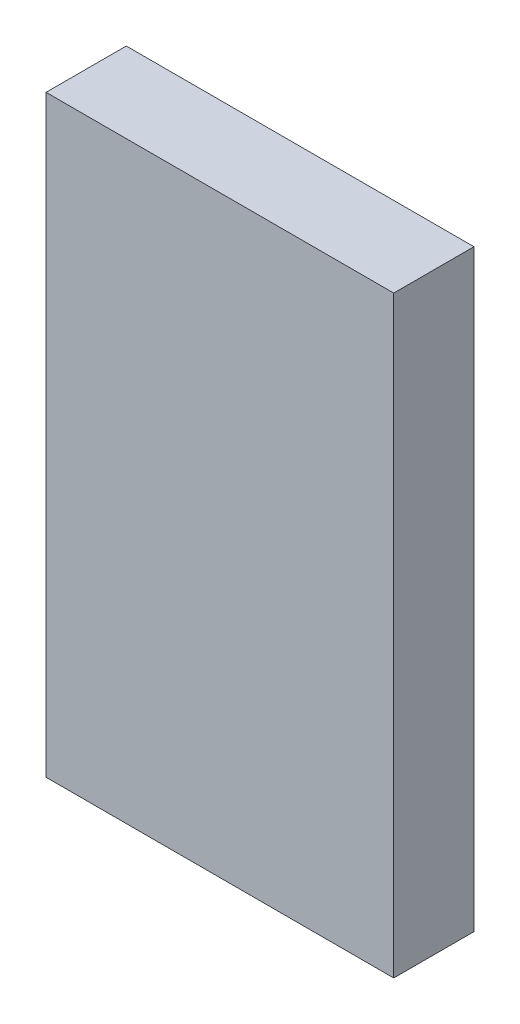
ISO-10303-21;
HEADER;
FILE_DESCRIPTION(('STEP AP214'),'2;1');
FILE_NAME('part.step','',(''),(''),'','','');
FILE_SCHEMA(('AUTOMOTIVE_DESIGN { 1 0 10303 214 1 1 1 1 }'));
ENDSEC;
DATA;
#1=APPLICATION_CONTEXT('core data for automotive mechanical design processes');
#2=APPLICATION_PROTOCOL_DEFINITION('international standard','automotive_design',2000,#1);
#3=PRODUCT_CONTEXT('',#1,'mechanical');
#4=PRODUCT('Part','Part','',(#3));
#5=PRODUCT_RELATED_PRODUCT_CATEGORY('part','',(#4));
#6=PRODUCT_DEFINITION_FORMATION('','',#4);
#7=PRODUCT_DEFINITION_CONTEXT('part definition',#1,'design');
#8=PRODUCT_DEFINITION('design','',#6,#7);
#9=PRODUCT_DEFINITION_SHAPE('','',#8);
#10=(LENGTH_UNIT() NAMED_UNIT(*) SI_UNIT(.MILLI.,.METRE.));
#11=(NAMED_UNIT(*) PLANE_ANGLE_UNIT() SI_UNIT($,.RADIAN.));
#12=(NAMED_UNIT(*) SI_UNIT($,.STERADIAN.) SOLID_ANGLE_UNIT());
#13=UNCERTAINTY_MEASURE_WITH_UNIT(LENGTH_MEASURE(1.E-05),#10,'distance_accuracy_value','');
#14=(GEOMETRIC_REPRESENTATION_CONTEXT(3) GLOBAL_UNCERTAINTY_ASSIGNED_CONTEXT((#13)) GLOBAL_UNIT_ASSIGNED_CONTEXT((#10,
#11,#12)) REPRESENTATION_CONTEXT('',''));
#15=CARTESIAN_POINT('',(0.,0.,0.));
#16=DIRECTION('',(0.,0.,1.));
#17=DIRECTION('',(1.,0.,0.));
#18=AXIS2_PLACEMENT_3D('',#15,#16,#17);
#19=CARTESIAN_POINT('',(0.,-19.18,-2.));
#20=DIRECTION('',(0.,-1.,0.));
#21=DIRECTION('',(0.,0.,-1.));
#22=AXIS2_PLACEMENT_3D('',#19,#20,#21);
#23=PLANE('',#22);
#24=DIRECTION('',(0.,0.,1.));
#25=VECTOR('',#24,1.);
#26=CARTESIAN_POINT('',(10.,-19.18,-2.));
#27=LINE('',#26,#25);
#28=CARTESIAN_POINT('',(10.,-19.18,-2.));
#29=VERTEX_POINT('',#28);
#30=CARTESIAN_POINT('',(10.,-19.18,1.));
#31=VERTEX_POINT('',#30);
#32=EDGE_CURVE('E166',#29,#31,#27,.T.);
#33=ORIENTED_EDGE('',*,*,#32,.T.);
#34=DIRECTION('',(1.,0.,0.));
#35=VECTOR('',#34,1.);
#36=CARTESIAN_POINT('',(10.,-19.18,1.));
#37=LINE('',#36,#35);
#38=CARTESIAN_POINT('',(-3.,-19.18,1.));
#39=VERTEX_POINT('',#38);
#40=EDGE_CURVE('E181',#39,#31,#37,.T.);
#41=ORIENTED_EDGE('',*,*,#40,.F.);
#42=DIRECTION('',(0.,0.,1.));
#43=VECTOR('',#42,1.);
#44=CARTESIAN_POINT('',(-3.,-19.18,-2.));
#45=LINE('',#44,#43);
#46=CARTESIAN_POINT('',(-3.,-19.18,-2.));
#47=VERTEX_POINT('',#46);
#48=EDGE_CURVE('E11',#47,#39,#45,.T.);
#49=ORIENTED_EDGE('',*,*,#48,.F.);
#50=DIRECTION('',(1.,0.,0.));
#51=VECTOR('',#50,1.);
#52=CARTESIAN_POINT('',(0.,-19.18,-2.));
#53=LINE('',#52,#51);
#54=EDGE_CURVE('E170',#47,#29,#53,.T.);
#55=ORIENTED_EDGE('',*,*,#54,.T.);
#56=EDGE_LOOP('',(#33,#41,#49,#55));
#57=FACE_BOUND('',#56,.T.);
#58=ADVANCED_FACE('F32',(#57),#23,.T.);
#59=CARTESIAN_POINT('',(-3.,0.,-2.));
#60=DIRECTION('',(1.,0.,0.));
#61=DIRECTION('',(0.,0.,-1.));
#62=AXIS2_PLACEMENT_3D('',#59,#60,#61);
#63=PLANE('',#62);
#64=ORIENTED_EDGE('',*,*,#48,.T.);
#65=DIRECTION('',(0.,-1.,0.));
#66=VECTOR('',#65,1.);
#67=CARTESIAN_POINT('',(-3.,3.,1.));
#68=LINE('',#67,#66);
#69=CARTESIAN_POINT('',(-3.,3.,1.));
#70=VERTEX_POINT('',#69);
#71=EDGE_CURVE('E275',#70,#39,#68,.T.);
#72=ORIENTED_EDGE('',*,*,#71,.F.);
#73=DIRECTION('',(0.,0.,1.));
#74=VECTOR('',#73,1.);
#75=CARTESIAN_POINT('',(-3.,3.,-2.));
#76=LINE('',#75,#74);
#77=CARTESIAN_POINT('',(-3.,3.,-2.));
#78=VERTEX_POINT('',#77);
#79=EDGE_CURVE('E42',#78,#70,#76,.T.);
#80=ORIENTED_EDGE('',*,*,#79,.F.);
#81=DIRECTION('',(0.,1.,0.));
#82=VECTOR('',#81,1.);
#83=CARTESIAN_POINT('',(-3.,0.,-2.));
#84=LINE('',#83,#82);
#85=EDGE_CURVE('E151',#47,#78,#84,.T.);
#86=ORIENTED_EDGE('',*,*,#85,.F.);
#87=EDGE_LOOP('',(#64,#72,#80,#86));
#88=FACE_BOUND('',#87,.T.);
#89=ADVANCED_FACE('F290',(#88),#63,.F.);
#90=CARTESIAN_POINT('',(0.,3.,-2.));
#91=DIRECTION('',(0.,-1.,0.));
#92=DIRECTION('',(0.,0.,-1.));
#93=AXIS2_PLACEMENT_3D('',#90,#91,#92);
#94=PLANE('',#93);
#95=ORIENTED_EDGE('',*,*,#79,.T.);
#96=DIRECTION('',(-1.,0.,0.));
#97=VECTOR('',#96,1.);
#98=CARTESIAN_POINT('',(10.,3.,1.));
#99=LINE('',#98,#97);
#100=CARTESIAN_POINT('',(10.,3.,1.));
#101=VERTEX_POINT('',#100);
#102=EDGE_CURVE('E162',#101,#70,#99,.T.);
#103=ORIENTED_EDGE('',*,*,#102,.F.);
#104=DIRECTION('',(0.,0.,1.));
#105=VECTOR('',#104,1.);
#106=CARTESIAN_POINT('',(10.,3.,-2.));
#107=LINE('',#106,#105);
#108=CARTESIAN_POINT('',(10.,3.,-2.));
#109=VERTEX_POINT('',#108);
#110=EDGE_CURVE('E158',#109,#101,#107,.T.);
#111=ORIENTED_EDGE('',*,*,#110,.F.);
#112=DIRECTION('',(1.,0.,0.));
#113=VECTOR('',#112,1.);
#114=CARTESIAN_POINT('',(0.,3.,-2.));
#115=LINE('',#114,#113);
#116=EDGE_CURVE('E145',#78,#109,#115,.T.);
#117=ORIENTED_EDGE('',*,*,#116,.F.);
#118=EDGE_LOOP('',(#95,#103,#111,#117));
#119=FACE_BOUND('',#118,.T.);
#120=ADVANCED_FACE('F159',(#119),#94,.F.);
#121=CARTESIAN_POINT('',(0.,-9.,-2.));
#122=DIRECTION('',(0.,1.,0.));
#123=DIRECTION('',(0.,0.,1.));
#124=AXIS2_PLACEMENT_3D('',#121,#122,#123);
#125=PLANE('',#124);
#126=DIRECTION('',(-1.,0.,0.));
#127=VECTOR('',#126,1.);
#128=CARTESIAN_POINT('',(0.,-9.,0.));
#129=LINE('',#128,#127);
#130=CARTESIAN_POINT('',(7.,-9.,0.));
#131=VERTEX_POINT('',#130);
#132=CARTESIAN_POINT('',(2.,-9.,0.));
#133=VERTEX_POINT('',#132);
#134=EDGE_CURVE('E177',#131,#133,#129,.T.);
#135=ORIENTED_EDGE('',*,*,#134,.F.);
#136=DIRECTION('',(0.,0.,1.));
#137=VECTOR('',#136,1.);
#138=CARTESIAN_POINT('',(7.,-9.,-2.));
#139=LINE('',#138,#137);
#140=CARTESIAN_POINT('',(7.,-9.,-2.));
#141=VERTEX_POINT('',#140);
#142=EDGE_CURVE('E96',#141,#131,#139,.T.);
#143=ORIENTED_EDGE('',*,*,#142,.F.);
#144=DIRECTION('',(-1.,0.,0.));
#145=VECTOR('',#144,1.);
#146=CARTESIAN_POINT('',(0.,-9.,-2.));
#147=LINE('',#146,#145);
#148=CARTESIAN_POINT('',(2.,-9.,-2.));
#149=VERTEX_POINT('',#148);
#150=EDGE_CURVE('E207',#141,#149,#147,.T.);
#151=ORIENTED_EDGE('',*,*,#150,.T.);
#152=DIRECTION('',(0.,0.,1.));
#153=VECTOR('',#152,1.);
#154=CARTESIAN_POINT('',(2.,-9.,-2.));
#155=LINE('',#154,#153);
#156=EDGE_CURVE('E36',#149,#133,#155,.T.);
#157=ORIENTED_EDGE('',*,*,#156,.T.);
#158=EDGE_LOOP('',(#135,#143,#151,#157));
#159=FACE_BOUND('',#158,.T.);
#160=ADVANCED_FACE('F34',(#159),#125,.T.);
#161=CARTESIAN_POINT('',(7.,0.,-2.));
#162=DIRECTION('',(1.,0.,0.));
#163=DIRECTION('',(0.,0.,-1.));
#164=AXIS2_PLACEMENT_3D('',#161,#162,#163);
#165=PLANE('',#164);
#166=DIRECTION('',(0.,1.,0.));
#167=VECTOR('',#166,1.);
#168=CARTESIAN_POINT('',(7.,0.,0.));
#169=LINE('',#168,#167);
#170=CARTESIAN_POINT('',(7.,-3.,0.));
#171=VERTEX_POINT('',#170);
#172=EDGE_CURVE('E206',#131,#171,#169,.T.);
#173=ORIENTED_EDGE('',*,*,#172,.T.);
#174=DIRECTION('',(0.,0.,1.));
#175=VECTOR('',#174,1.);
#176=CARTESIAN_POINT('',(7.,-3.,-2.));
#177=LINE('',#176,#175);
#178=CARTESIAN_POINT('',(7.,-3.,-2.));
#179=VERTEX_POINT('',#178);
#180=EDGE_CURVE('E89',#179,#171,#177,.T.);
#181=ORIENTED_EDGE('',*,*,#180,.F.);
#182=DIRECTION('',(0.,1.,0.));
#183=VECTOR('',#182,1.);
#184=CARTESIAN_POINT('',(7.,0.,-2.));
#185=LINE('',#184,#183);
#186=EDGE_CURVE('E172',#141,#179,#185,.T.);
#187=ORIENTED_EDGE('',*,*,#186,.F.);
#188=ORIENTED_EDGE('',*,*,#142,.T.);
#189=EDGE_LOOP('',(#173,#181,#187,#188));
#190=FACE_BOUND('',#189,.T.);
#191=ADVANCED_FACE('F244',(#190),#165,.F.);
#192=CARTESIAN_POINT('',(0.,-3.,-2.));
#193=DIRECTION('',(0.,-1.,0.));
#194=DIRECTION('',(0.,0.,-1.));
#195=AXIS2_PLACEMENT_3D('',#192,#193,#194);
#196=PLANE('',#195);
#197=DIRECTION('',(1.,0.,0.));
#198=VECTOR('',#197,1.);
#199=CARTESIAN_POINT('',(0.,-3.,0.));
#200=LINE('',#199,#198);
#201=CARTESIAN_POINT('',(2.,-3.,0.));
#202=VERTEX_POINT('',#201);
#203=EDGE_CURVE('E203',#202,#171,#200,.T.);
#204=ORIENTED_EDGE('',*,*,#203,.F.);
#205=DIRECTION('',(0.,0.,1.));
#206=VECTOR('',#205,1.);
#207=CARTESIAN_POINT('',(2.,-3.,-2.));
#208=LINE('',#207,#206);
#209=CARTESIAN_POINT('',(2.,-3.,-2.));
#210=VERTEX_POINT('',#209);
#211=EDGE_CURVE('E213',#210,#202,#208,.T.);
#212=ORIENTED_EDGE('',*,*,#211,.F.);
#213=DIRECTION('',(1.,0.,0.));
#214=VECTOR('',#213,1.);
#215=CARTESIAN_POINT('',(0.,-3.,-2.));
#216=LINE('',#215,#214);
#217=EDGE_CURVE('E246',#210,#179,#216,.T.);
#218=ORIENTED_EDGE('',*,*,#217,.T.);
#219=ORIENTED_EDGE('',*,*,#180,.T.);
#220=EDGE_LOOP('',(#204,#212,#218,#219));
#221=FACE_BOUND('',#220,.T.);
#222=ADVANCED_FACE('F247',(#221),#196,.T.);
#223=CARTESIAN_POINT('',(2.,0.,-2.));
#224=DIRECTION('',(-1.,0.,0.));
#225=DIRECTION('',(0.,-1.,0.));
#226=AXIS2_PLACEMENT_3D('',#223,#224,#225);
#227=PLANE('',#226);
#228=DIRECTION('',(0.,-1.,0.));
#229=VECTOR('',#228,1.);
#230=CARTESIAN_POINT('',(2.,0.,0.));
#231=LINE('',#230,#229);
#232=CARTESIAN_POINT('',(2.,0.,0.));
#233=VERTEX_POINT('',#232);
#234=EDGE_CURVE('E200',#233,#202,#231,.T.);
#235=ORIENTED_EDGE('',*,*,#234,.F.);
#236=DIRECTION('',(0.,0.,1.));
#237=VECTOR('',#236,1.);
#238=CARTESIAN_POINT('',(2.,0.,-2.));
#239=LINE('',#238,#237);
#240=CARTESIAN_POINT('',(2.,0.,-2.));
#241=VERTEX_POINT('',#240);
#242=EDGE_CURVE('E215',#241,#233,#239,.T.);
#243=ORIENTED_EDGE('',*,*,#242,.F.);
#244=DIRECTION('',(0.,-1.,0.));
#245=VECTOR('',#244,1.);
#246=CARTESIAN_POINT('',(2.,0.,-2.));
#247=LINE('',#246,#245);
#248=EDGE_CURVE('E251',#241,#210,#247,.T.);
#249=ORIENTED_EDGE('',*,*,#248,.T.);
#250=ORIENTED_EDGE('',*,*,#211,.T.);
#251=EDGE_LOOP('',(#235,#243,#249,#250));
#252=FACE_BOUND('',#251,.T.);
#253=ADVANCED_FACE('F304',(#252),#227,.T.);
#254=CARTESIAN_POINT('',(0.,0.,-2.));
#255=DIRECTION('',(0.,-1.,0.));
#256=DIRECTION('',(0.,0.,-1.));
#257=AXIS2_PLACEMENT_3D('',#254,#255,#256);
#258=PLANE('',#257);
#259=DIRECTION('',(1.,0.,0.));
#260=VECTOR('',#259,1.);
#261=CARTESIAN_POINT('',(0.,0.,0.));
#262=LINE('',#261,#260);
#263=CARTESIAN_POINT('',(0.,0.,0.));
#264=VERTEX_POINT('',#263);
#265=EDGE_CURVE('E197',#264,#233,#262,.T.);
#266=ORIENTED_EDGE('',*,*,#265,.F.);
#267=DIRECTION('',(0.,0.,1.));
#268=VECTOR('',#267,1.);
#269=CARTESIAN_POINT('',(0.,0.,-2.));
#270=LINE('',#269,#268);
#271=CARTESIAN_POINT('',(0.,0.,-2.));
#272=VERTEX_POINT('',#271);
#273=EDGE_CURVE('E217',#272,#264,#270,.T.);
#274=ORIENTED_EDGE('',*,*,#273,.F.);
#275=DIRECTION('',(1.,0.,0.));
#276=VECTOR('',#275,1.);
#277=CARTESIAN_POINT('',(0.,0.,-2.));
#278=LINE('',#277,#276);
#279=EDGE_CURVE('E253',#272,#241,#278,.T.);
#280=ORIENTED_EDGE('',*,*,#279,.T.);
#281=ORIENTED_EDGE('',*,*,#242,.T.);
#282=EDGE_LOOP('',(#266,#274,#280,#281));
#283=FACE_BOUND('',#282,.T.);
#284=ADVANCED_FACE('F307',(#283),#258,.T.);
#285=CARTESIAN_POINT('',(0.,0.,-2.));
#286=DIRECTION('',(-1.,0.,0.));
#287=DIRECTION('',(0.,-1.,0.));
#288=AXIS2_PLACEMENT_3D('',#285,#286,#287);
#289=PLANE('',#288);
#290=DIRECTION('',(0.,-1.,0.));
#291=VECTOR('',#290,1.);
#292=CARTESIAN_POINT('',(0.,0.,0.));
#293=LINE('',#292,#291);
#294=CARTESIAN_POINT('',(0.,-5.,0.));
#295=VERTEX_POINT('',#294);
#296=EDGE_CURVE('E195',#264,#295,#293,.T.);
#297=ORIENTED_EDGE('',*,*,#296,.T.);
#298=DIRECTION('',(0.,0.,1.));
#299=VECTOR('',#298,1.);
#300=CARTESIAN_POINT('',(0.,-5.,-2.));
#301=LINE('',#300,#299);
#302=CARTESIAN_POINT('',(0.,-5.,-2.));
#303=VERTEX_POINT('',#302);
#304=EDGE_CURVE('E219',#303,#295,#301,.T.);
#305=ORIENTED_EDGE('',*,*,#304,.F.);
#306=DIRECTION('',(0.,-1.,0.));
#307=VECTOR('',#306,1.);
#308=CARTESIAN_POINT('',(0.,0.,-2.));
#309=LINE('',#308,#307);
#310=EDGE_CURVE('E258',#272,#303,#309,.T.);
#311=ORIENTED_EDGE('',*,*,#310,.F.);
#312=ORIENTED_EDGE('',*,*,#273,.T.);
#313=EDGE_LOOP('',(#297,#305,#311,#312));
#314=FACE_BOUND('',#313,.T.);
#315=ADVANCED_FACE('F311',(#314),#289,.F.);
#316=CARTESIAN_POINT('',(0.,-5.,-2.));
#317=DIRECTION('',(0.,-1.,0.));
#318=DIRECTION('',(1.,0.,0.));
#319=AXIS2_PLACEMENT_3D('',#316,#317,#318);
#320=PLANE('',#319);
#321=DIRECTION('',(1.,0.,0.));
#322=VECTOR('',#321,1.);
#323=CARTESIAN_POINT('',(0.,-5.,0.));
#324=LINE('',#323,#322);
#325=CARTESIAN_POINT('',(5.,-5.,0.));
#326=VERTEX_POINT('',#325);
#327=EDGE_CURVE('E193',#295,#326,#324,.T.);
#328=ORIENTED_EDGE('',*,*,#327,.T.);
#329=DIRECTION('',(0.,0.,1.));
#330=VECTOR('',#329,1.);
#331=CARTESIAN_POINT('',(5.,-5.,-2.));
#332=LINE('',#331,#330);
#333=CARTESIAN_POINT('',(5.,-5.,-2.));
#334=VERTEX_POINT('',#333);
#335=EDGE_CURVE('E222',#334,#326,#332,.T.);
#336=ORIENTED_EDGE('',*,*,#335,.F.);
#337=DIRECTION('',(1.,0.,0.));
#338=VECTOR('',#337,1.);
#339=CARTESIAN_POINT('',(0.,-5.,-2.));
#340=LINE('',#339,#338);
#341=EDGE_CURVE('E260',#303,#334,#340,.T.);
#342=ORIENTED_EDGE('',*,*,#341,.F.);
#343=ORIENTED_EDGE('',*,*,#304,.T.);
#344=EDGE_LOOP('',(#328,#336,#342,#343));
#345=FACE_BOUND('',#344,.T.);
#346=ADVANCED_FACE('F315',(#345),#320,.F.);
#347=CARTESIAN_POINT('',(5.,0.,-2.));
#348=DIRECTION('',(-1.,0.,0.));
#349=DIRECTION('',(0.,0.,1.));
#350=AXIS2_PLACEMENT_3D('',#347,#348,#349);
#351=PLANE('',#350);
#352=DIRECTION('',(0.,-1.,0.));
#353=VECTOR('',#352,1.);
#354=CARTESIAN_POINT('',(5.,0.,0.));
#355=LINE('',#354,#353);
#356=CARTESIAN_POINT('',(5.,-7.,0.));
#357=VERTEX_POINT('',#356);
#358=EDGE_CURVE('E191',#326,#357,#355,.T.);
#359=ORIENTED_EDGE('',*,*,#358,.T.);
#360=DIRECTION('',(0.,0.,1.));
#361=VECTOR('',#360,1.);
#362=CARTESIAN_POINT('',(5.,-7.,-2.));
#363=LINE('',#362,#361);
#364=CARTESIAN_POINT('',(5.,-7.,-2.));
#365=VERTEX_POINT('',#364);
#366=EDGE_CURVE('E225',#365,#357,#363,.T.);
#367=ORIENTED_EDGE('',*,*,#366,.F.);
#368=DIRECTION('',(0.,-1.,0.));
#369=VECTOR('',#368,1.);
#370=CARTESIAN_POINT('',(5.,0.,-2.));
#371=LINE('',#370,#369);
#372=EDGE_CURVE('E262',#334,#365,#371,.T.);
#373=ORIENTED_EDGE('',*,*,#372,.F.);
#374=ORIENTED_EDGE('',*,*,#335,.T.);
#375=EDGE_LOOP('',(#359,#367,#373,#374));
#376=FACE_BOUND('',#375,.T.);
#377=ADVANCED_FACE('F319',(#376),#351,.F.);
#378=CARTESIAN_POINT('',(0.,-7.,-2.));
#379=DIRECTION('',(0.,1.,0.));
#380=DIRECTION('',(-1.,0.,0.));
#381=AXIS2_PLACEMENT_3D('',#378,#379,#380);
#382=PLANE('',#381);
#383=DIRECTION('',(-1.,0.,0.));
#384=VECTOR('',#383,1.);
#385=CARTESIAN_POINT('',(0.,-7.,0.));
#386=LINE('',#385,#384);
#387=CARTESIAN_POINT('',(0.,-7.,0.));
#388=VERTEX_POINT('',#387);
#389=EDGE_CURVE('E189',#357,#388,#386,.T.);
#390=ORIENTED_EDGE('',*,*,#389,.T.);
#391=DIRECTION('',(0.,0.,1.));
#392=VECTOR('',#391,1.);
#393=CARTESIAN_POINT('',(0.,-7.,-2.));
#394=LINE('',#393,#392);
#395=CARTESIAN_POINT('',(0.,-7.,-2.));
#396=VERTEX_POINT('',#395);
#397=EDGE_CURVE('E228',#396,#388,#394,.T.);
#398=ORIENTED_EDGE('',*,*,#397,.F.);
#399=DIRECTION('',(-1.,0.,0.));
#400=VECTOR('',#399,1.);
#401=CARTESIAN_POINT('',(0.,-7.,-2.));
#402=LINE('',#401,#400);
#403=EDGE_CURVE('E264',#365,#396,#402,.T.);
#404=ORIENTED_EDGE('',*,*,#403,.F.);
#405=ORIENTED_EDGE('',*,*,#366,.T.);
#406=EDGE_LOOP('',(#390,#398,#404,#405));
#407=FACE_BOUND('',#406,.T.);
#408=ADVANCED_FACE('F323',(#407),#382,.F.);
#409=CARTESIAN_POINT('',(0.,0.,-2.));
#410=DIRECTION('',(-1.,0.,0.));
#411=DIRECTION('',(0.,-1.,0.));
#412=AXIS2_PLACEMENT_3D('',#409,#410,#411);
#413=PLANE('',#412);
#414=DIRECTION('',(0.,-1.,0.));
#415=VECTOR('',#414,1.);
#416=CARTESIAN_POINT('',(0.,0.,0.));
#417=LINE('',#416,#415);
#418=CARTESIAN_POINT('',(0.,-16.18,0.));
#419=VERTEX_POINT('',#418);
#420=EDGE_CURVE('E187',#388,#419,#417,.T.);
#421=ORIENTED_EDGE('',*,*,#420,.T.);
#422=DIRECTION('',(0.,0.,1.));
#423=VECTOR('',#422,1.);
#424=CARTESIAN_POINT('',(0.,-16.18,-2.));
#425=LINE('',#424,#423);
#426=CARTESIAN_POINT('',(0.,-16.18,-2.));
#427=VERTEX_POINT('',#426);
#428=EDGE_CURVE('E231',#427,#419,#425,.T.);
#429=ORIENTED_EDGE('',*,*,#428,.F.);
#430=DIRECTION('',(0.,-1.,0.));
#431=VECTOR('',#430,1.);
#432=CARTESIAN_POINT('',(0.,0.,-2.));
#433=LINE('',#432,#431);
#434=EDGE_CURVE('E266',#396,#427,#433,.T.);
#435=ORIENTED_EDGE('',*,*,#434,.F.);
#436=ORIENTED_EDGE('',*,*,#397,.T.);
#437=EDGE_LOOP('',(#421,#429,#435,#436));
#438=FACE_BOUND('',#437,.T.);
#439=ADVANCED_FACE('F327',(#438),#413,.F.);
#440=CARTESIAN_POINT('',(0.,-16.18,-2.));
#441=DIRECTION('',(0.,-1.,0.));
#442=DIRECTION('',(0.,0.,-1.));
#443=AXIS2_PLACEMENT_3D('',#440,#441,#442);
#444=PLANE('',#443);
#445=DIRECTION('',(1.,0.,0.));
#446=VECTOR('',#445,1.);
#447=CARTESIAN_POINT('',(0.,-16.18,0.));
#448=LINE('',#447,#446);
#449=CARTESIAN_POINT('',(2.,-16.18,0.));
#450=VERTEX_POINT('',#449);
#451=EDGE_CURVE('E184',#419,#450,#448,.T.);
#452=ORIENTED_EDGE('',*,*,#451,.T.);
#453=DIRECTION('',(0.,0.,1.));
#454=VECTOR('',#453,1.);
#455=CARTESIAN_POINT('',(2.,-16.18,-2.));
#456=LINE('',#455,#454);
#457=CARTESIAN_POINT('',(2.,-16.18,-2.));
#458=VERTEX_POINT('',#457);
#459=EDGE_CURVE('E233',#458,#450,#456,.T.);
#460=ORIENTED_EDGE('',*,*,#459,.F.);
#461=DIRECTION('',(1.,0.,0.));
#462=VECTOR('',#461,1.);
#463=CARTESIAN_POINT('',(0.,-16.18,-2.));
#464=LINE('',#463,#462);
#465=EDGE_CURVE('E268',#427,#458,#464,.T.);
#466=ORIENTED_EDGE('',*,*,#465,.F.);
#467=ORIENTED_EDGE('',*,*,#428,.T.);
#468=EDGE_LOOP('',(#452,#460,#466,#467));
#469=FACE_BOUND('',#468,.T.);
#470=ADVANCED_FACE('F331',(#469),#444,.F.);
#471=CARTESIAN_POINT('',(2.,0.,-2.));
#472=DIRECTION('',(-1.,0.,0.));
#473=DIRECTION('',(0.,-1.,0.));
#474=AXIS2_PLACEMENT_3D('',#471,#472,#473);
#475=PLANE('',#474);
#476=DIRECTION('',(0.,-1.,0.));
#477=VECTOR('',#476,1.);
#478=CARTESIAN_POINT('',(2.,0.,0.));
#479=LINE('',#478,#477);
#480=EDGE_CURVE('E180',#133,#450,#479,.T.);
#481=ORIENTED_EDGE('',*,*,#480,.F.);
#482=ORIENTED_EDGE('',*,*,#156,.F.);
#483=DIRECTION('',(0.,-1.,0.));
#484=VECTOR('',#483,1.);
#485=CARTESIAN_POINT('',(2.,0.,-2.));
#486=LINE('',#485,#484);
#487=EDGE_CURVE('E270',#149,#458,#486,.T.);
#488=ORIENTED_EDGE('',*,*,#487,.T.);
#489=ORIENTED_EDGE('',*,*,#459,.T.);
#490=EDGE_LOOP('',(#481,#482,#488,#489));
#491=FACE_BOUND('',#490,.T.);
#492=ADVANCED_FACE('F240',(#491),#475,.T.);
#493=CARTESIAN_POINT('',(10.,0.,-2.));
#494=DIRECTION('',(1.,0.,0.));
#495=DIRECTION('',(0.,0.,-1.));
#496=AXIS2_PLACEMENT_3D('',#493,#494,#495);
#497=PLANE('',#496);
#498=ORIENTED_EDGE('',*,*,#110,.T.);
#499=DIRECTION('',(0.,1.,0.));
#500=VECTOR('',#499,1.);
#501=CARTESIAN_POINT('',(10.,3.,1.));
#502=LINE('',#501,#500);
#503=EDGE_CURVE('E279',#31,#101,#502,.T.);
#504=ORIENTED_EDGE('',*,*,#503,.F.);
#505=ORIENTED_EDGE('',*,*,#32,.F.);
#506=DIRECTION('',(0.,1.,0.));
#507=VECTOR('',#506,1.);
#508=CARTESIAN_POINT('',(10.,0.,-2.));
#509=LINE('',#508,#507);
#510=EDGE_CURVE('E150',#29,#109,#509,.T.);
#511=ORIENTED_EDGE('',*,*,#510,.T.);
#512=EDGE_LOOP('',(#498,#504,#505,#511));
#513=FACE_BOUND('',#512,.T.);
#514=ADVANCED_FACE('F168',(#513),#497,.T.);
#515=CARTESIAN_POINT('',(0.,0.,-2.));
#516=DIRECTION('',(0.,0.,1.));
#517=DIRECTION('',(1.,0.,0.));
#518=AXIS2_PLACEMENT_3D('',#515,#516,#517);
#519=PLANE('',#518);
#520=ORIENTED_EDGE('',*,*,#150,.F.);
#521=ORIENTED_EDGE('',*,*,#186,.T.);
#522=ORIENTED_EDGE('',*,*,#217,.F.);
#523=ORIENTED_EDGE('',*,*,#248,.F.);
#524=ORIENTED_EDGE('',*,*,#279,.F.);
#525=ORIENTED_EDGE('',*,*,#310,.T.);
#526=ORIENTED_EDGE('',*,*,#341,.T.);
#527=ORIENTED_EDGE('',*,*,#372,.T.);
#528=ORIENTED_EDGE('',*,*,#403,.T.);
#529=ORIENTED_EDGE('',*,*,#434,.T.);
#530=ORIENTED_EDGE('',*,*,#465,.T.);
#531=ORIENTED_EDGE('',*,*,#487,.F.);
#532=EDGE_LOOP('',(#520,#521,#522,#523,#524,#525,#526,#527,#528,#529,#530,#531));
#533=FACE_BOUND('',#532,.T.);
#534=ORIENTED_EDGE('',*,*,#54,.F.);
#535=ORIENTED_EDGE('',*,*,#85,.T.);
#536=ORIENTED_EDGE('',*,*,#116,.T.);
#537=ORIENTED_EDGE('',*,*,#510,.F.);
#538=EDGE_LOOP('',(#534,#535,#536,#537));
#539=FACE_BOUND('',#538,.T.);
#540=ADVANCED_FACE('F148',(#533,#539),#519,.F.);
#541=CARTESIAN_POINT('',(0.,0.,1.));
#542=DIRECTION('',(0.,0.,-1.));
#543=DIRECTION('',(-1.,0.,0.));
#544=AXIS2_PLACEMENT_3D('',#541,#542,#543);
#545=PLANE('',#544);
#546=ORIENTED_EDGE('',*,*,#503,.T.);
#547=ORIENTED_EDGE('',*,*,#102,.T.);
#548=ORIENTED_EDGE('',*,*,#71,.T.);
#549=ORIENTED_EDGE('',*,*,#40,.T.);
#550=EDGE_LOOP('',(#546,#547,#548,#549));
#551=FACE_BOUND('',#550,.T.);
#552=ADVANCED_FACE('F281',(#551),#545,.F.);
#553=CARTESIAN_POINT('',(0.,0.,0.));
#554=DIRECTION('',(0.,0.,-1.));
#555=DIRECTION('',(-1.,0.,0.));
#556=AXIS2_PLACEMENT_3D('',#553,#554,#555);
#557=PLANE('',#556);
#558=ORIENTED_EDGE('',*,*,#172,.F.);
#559=ORIENTED_EDGE('',*,*,#134,.T.);
#560=ORIENTED_EDGE('',*,*,#480,.T.);
#561=ORIENTED_EDGE('',*,*,#451,.F.);
#562=ORIENTED_EDGE('',*,*,#420,.F.);
#563=ORIENTED_EDGE('',*,*,#389,.F.);
#564=ORIENTED_EDGE('',*,*,#358,.F.);
#565=ORIENTED_EDGE('',*,*,#327,.F.);
#566=ORIENTED_EDGE('',*,*,#296,.F.);
#567=ORIENTED_EDGE('',*,*,#265,.T.);
#568=ORIENTED_EDGE('',*,*,#234,.T.);
#569=ORIENTED_EDGE('',*,*,#203,.T.);
#570=EDGE_LOOP('',(#558,#559,#560,#561,#562,#563,#564,#565,#566,#567,#568,#569));
#571=FACE_BOUND('',#570,.T.);
#572=ADVANCED_FACE('F243',(#571),#557,.T.);
#573=CLOSED_SHELL('',(#58,#89,#120,#160,#191,#222,#253,#284,#315,#346,#377,#408,#439,#470,#492,
#514,#540,#552,#572));
#574=MANIFOLD_SOLID_BREP('B2',#573);
#575=ADVANCED_BREP_SHAPE_REPRESENTATION('',(#18,#574),#14);
#576=SHAPE_DEFINITION_REPRESENTATION(#9,#575);
ENDSEC;
END-ISO-10303-21;
